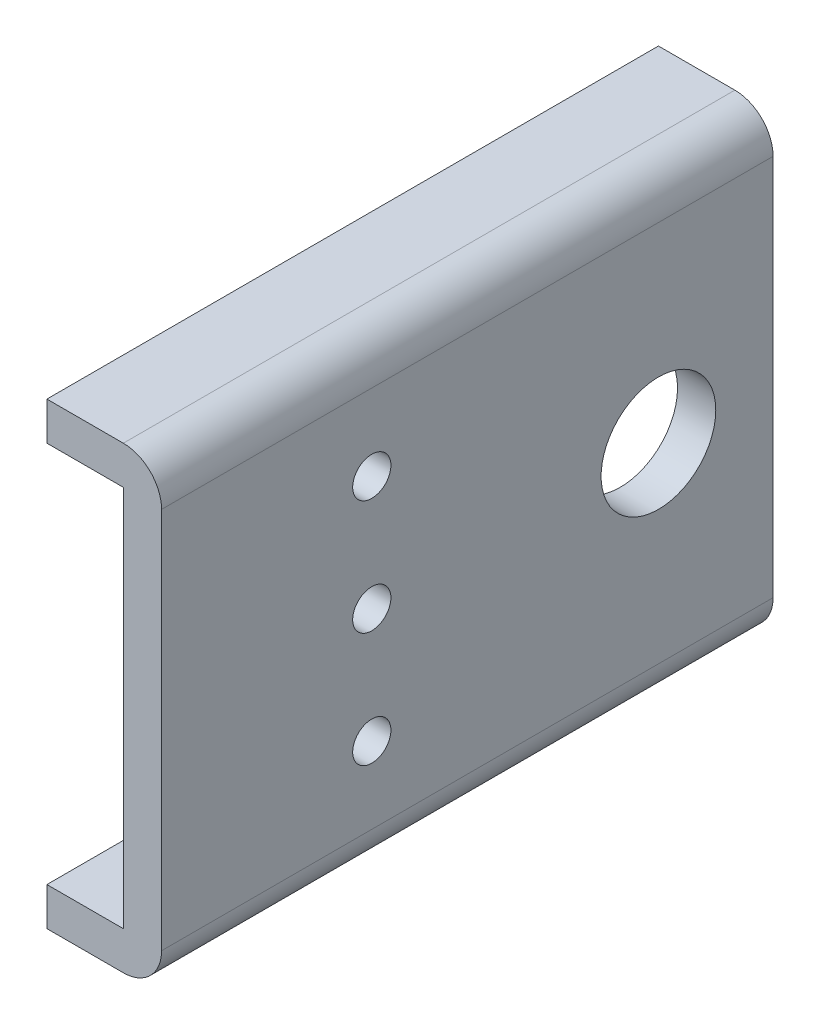
ISO-10303-21;
HEADER;
FILE_DESCRIPTION(('STEP AP214'),'2;1');
FILE_NAME('part.step','',(''),(''),'','','');
FILE_SCHEMA(('AUTOMOTIVE_DESIGN { 1 0 10303 214 1 1 1 1 }'));
ENDSEC;
DATA;
#1=APPLICATION_CONTEXT('core data for automotive mechanical design processes');
#2=APPLICATION_PROTOCOL_DEFINITION('international standard','automotive_design',2000,#1);
#3=PRODUCT_CONTEXT('',#1,'mechanical');
#4=PRODUCT('Part','Part','',(#3));
#5=PRODUCT_RELATED_PRODUCT_CATEGORY('part','',(#4));
#6=PRODUCT_DEFINITION_FORMATION('','',#4);
#7=PRODUCT_DEFINITION_CONTEXT('part definition',#1,'design');
#8=PRODUCT_DEFINITION('design','',#6,#7);
#9=PRODUCT_DEFINITION_SHAPE('','',#8);
#10=(LENGTH_UNIT() NAMED_UNIT(*) SI_UNIT(.MILLI.,.METRE.));
#11=(NAMED_UNIT(*) PLANE_ANGLE_UNIT() SI_UNIT($,.RADIAN.));
#12=(NAMED_UNIT(*) SI_UNIT($,.STERADIAN.) SOLID_ANGLE_UNIT());
#13=UNCERTAINTY_MEASURE_WITH_UNIT(LENGTH_MEASURE(1.E-05),#10,'distance_accuracy_value','');
#14=(GEOMETRIC_REPRESENTATION_CONTEXT(3) GLOBAL_UNCERTAINTY_ASSIGNED_CONTEXT((#13)) GLOBAL_UNIT_ASSIGNED_CONTEXT((#10,
#11,#12)) REPRESENTATION_CONTEXT('',''));
#15=CARTESIAN_POINT('',(0.,0.,0.));
#16=DIRECTION('',(0.,0.,1.));
#17=DIRECTION('',(1.,0.,0.));
#18=AXIS2_PLACEMENT_3D('',#15,#16,#17);
#19=CARTESIAN_POINT('',(0.,-19.05,0.));
#20=DIRECTION('',(0.,1.,0.));
#21=DIRECTION('',(-1.,0.,0.));
#22=AXIS2_PLACEMENT_3D('',#19,#20,#21);
#23=PLANE('',#22);
#24=DIRECTION('',(0.,0.,1.));
#25=VECTOR('',#24,1.);
#26=CARTESIAN_POINT('',(-9.525,-19.05,0.));
#27=LINE('',#26,#25);
#28=CARTESIAN_POINT('',(-9.525,-19.05,50.8));
#29=VERTEX_POINT('',#28);
#30=CARTESIAN_POINT('',(-9.52500000000001,-19.05,0.));
#31=VERTEX_POINT('',#30);
#32=EDGE_CURVE('E103',#29,#31,#27,.F.);
#33=ORIENTED_EDGE('',*,*,#32,.T.);
#34=DIRECTION('',(1.,0.,0.));
#35=VECTOR('',#34,1.);
#36=CARTESIAN_POINT('',(-3.17499999999999,-19.05,0.));
#37=LINE('',#36,#35);
#38=CARTESIAN_POINT('',(-3.17499999999999,-19.05,0.));
#39=VERTEX_POINT('',#38);
#40=EDGE_CURVE('E101',#31,#39,#37,.T.);
#41=ORIENTED_EDGE('',*,*,#40,.T.);
#42=DIRECTION('',(0.,0.,-1.));
#43=VECTOR('',#42,1.);
#44=CARTESIAN_POINT('',(-3.17499999999999,-19.05,0.));
#45=LINE('',#44,#43);
#46=CARTESIAN_POINT('',(-3.17499999999999,-19.05,50.8));
#47=VERTEX_POINT('',#46);
#48=EDGE_CURVE('E90',#47,#39,#45,.T.);
#49=ORIENTED_EDGE('',*,*,#48,.F.);
#50=DIRECTION('',(-1.,0.,0.));
#51=VECTOR('',#50,1.);
#52=CARTESIAN_POINT('',(-9.525,-19.05,50.8));
#53=LINE('',#52,#51);
#54=EDGE_CURVE('E97',#47,#29,#53,.T.);
#55=ORIENTED_EDGE('',*,*,#54,.T.);
#56=EDGE_LOOP('',(#33,#41,#49,#55));
#57=FACE_BOUND('',#56,.T.);
#58=ADVANCED_FACE('F17',(#57),#23,.F.);
#59=CARTESIAN_POINT('',(0.,19.05,0.));
#60=DIRECTION('',(0.,-1.,0.));
#61=DIRECTION('',(1.,0.,0.));
#62=AXIS2_PLACEMENT_3D('',#59,#60,#61);
#63=PLANE('',#62);
#64=DIRECTION('',(0.,0.,1.));
#65=VECTOR('',#64,1.);
#66=CARTESIAN_POINT('',(-9.525,19.05,50.8));
#67=LINE('',#66,#65);
#68=CARTESIAN_POINT('',(-9.525,19.05,0.));
#69=VERTEX_POINT('',#68);
#70=CARTESIAN_POINT('',(-9.52500000000001,19.05,50.8));
#71=VERTEX_POINT('',#70);
#72=EDGE_CURVE('E146',#69,#71,#67,.T.);
#73=ORIENTED_EDGE('',*,*,#72,.T.);
#74=DIRECTION('',(1.,0.,0.));
#75=VECTOR('',#74,1.);
#76=CARTESIAN_POINT('',(-3.17499999999999,19.05,50.8));
#77=LINE('',#76,#75);
#78=CARTESIAN_POINT('',(-3.17499999999999,19.05,50.8));
#79=VERTEX_POINT('',#78);
#80=EDGE_CURVE('E140',#71,#79,#77,.T.);
#81=ORIENTED_EDGE('',*,*,#80,.T.);
#82=DIRECTION('',(0.,0.,1.));
#83=VECTOR('',#82,1.);
#84=CARTESIAN_POINT('',(-3.17499999999999,19.05,50.8));
#85=LINE('',#84,#83);
#86=CARTESIAN_POINT('',(-3.17499999999999,19.05,0.));
#87=VERTEX_POINT('',#86);
#88=EDGE_CURVE('E98',#87,#79,#85,.T.);
#89=ORIENTED_EDGE('',*,*,#88,.F.);
#90=DIRECTION('',(1.,0.,0.));
#91=VECTOR('',#90,1.);
#92=CARTESIAN_POINT('',(-9.525,19.05,0.));
#93=LINE('',#92,#91);
#94=EDGE_CURVE('E116',#87,#69,#93,.F.);
#95=ORIENTED_EDGE('',*,*,#94,.T.);
#96=EDGE_LOOP('',(#73,#81,#89,#95));
#97=FACE_BOUND('',#96,.T.);
#98=ADVANCED_FACE('F256',(#97),#63,.F.);
#99=CARTESIAN_POINT('',(-3.175,15.875,50.8));
#100=DIRECTION('',(0.,0.,1.));
#101=DIRECTION('',(0.,-1.,0.));
#102=AXIS2_PLACEMENT_3D('',#99,#100,#101);
#103=CYLINDRICAL_SURFACE('',#102,3.175);
#104=CARTESIAN_POINT('',(-3.175,15.875,0.));
#105=DIRECTION('',(0.,0.,1.));
#106=DIRECTION('',(0.,-1.,0.));
#107=AXIS2_PLACEMENT_3D('',#104,#105,#106);
#108=CIRCLE('',#107,3.175);
#109=CARTESIAN_POINT('',(0.,15.875,0.));
#110=VERTEX_POINT('',#109);
#111=EDGE_CURVE('E114',#87,#110,#108,.F.);
#112=ORIENTED_EDGE('',*,*,#111,.F.);
#113=ORIENTED_EDGE('',*,*,#88,.T.);
#114=CARTESIAN_POINT('',(-3.175,15.875,50.8));
#115=DIRECTION('',(0.,0.,1.));
#116=DIRECTION('',(0.,-1.,0.));
#117=AXIS2_PLACEMENT_3D('',#114,#115,#116);
#118=CIRCLE('',#117,3.175);
#119=CARTESIAN_POINT('',(0.,15.875,50.8));
#120=VERTEX_POINT('',#119);
#121=EDGE_CURVE('E191',#79,#120,#118,.F.);
#122=ORIENTED_EDGE('',*,*,#121,.T.);
#123=DIRECTION('',(0.,0.,-1.));
#124=VECTOR('',#123,1.);
#125=CARTESIAN_POINT('',(0.,15.875,0.));
#126=LINE('',#125,#124);
#127=EDGE_CURVE('E193',#110,#120,#126,.F.);
#128=ORIENTED_EDGE('',*,*,#127,.F.);
#129=EDGE_LOOP('',(#112,#113,#122,#128));
#130=FACE_BOUND('',#129,.T.);
#131=ADVANCED_FACE('F258',(#130),#103,.T.);
#132=CARTESIAN_POINT('',(-3.175,-15.875,0.));
#133=DIRECTION('',(0.,0.,-1.));
#134=DIRECTION('',(-1.,0.,0.));
#135=AXIS2_PLACEMENT_3D('',#132,#133,#134);
#136=CYLINDRICAL_SURFACE('',#135,3.175);
#137=CARTESIAN_POINT('',(-3.175,-15.875,50.8));
#138=DIRECTION('',(0.,0.,-1.));
#139=DIRECTION('',(-1.,0.,0.));
#140=AXIS2_PLACEMENT_3D('',#137,#138,#139);
#141=CIRCLE('',#140,3.175);
#142=CARTESIAN_POINT('',(0.,-15.875,50.8));
#143=VERTEX_POINT('',#142);
#144=EDGE_CURVE('E95',#47,#143,#141,.F.);
#145=ORIENTED_EDGE('',*,*,#144,.F.);
#146=ORIENTED_EDGE('',*,*,#48,.T.);
#147=CARTESIAN_POINT('',(-3.175,-15.875,0.));
#148=DIRECTION('',(0.,0.,-1.));
#149=DIRECTION('',(-1.,0.,0.));
#150=AXIS2_PLACEMENT_3D('',#147,#148,#149);
#151=CIRCLE('',#150,3.175);
#152=CARTESIAN_POINT('',(0.,-15.875,0.));
#153=VERTEX_POINT('',#152);
#154=EDGE_CURVE('E20',#39,#153,#151,.F.);
#155=ORIENTED_EDGE('',*,*,#154,.T.);
#156=DIRECTION('',(0.,0.,-1.));
#157=VECTOR('',#156,1.);
#158=CARTESIAN_POINT('',(0.,-15.875,0.));
#159=LINE('',#158,#157);
#160=EDGE_CURVE('E197',#143,#153,#159,.T.);
#161=ORIENTED_EDGE('',*,*,#160,.F.);
#162=EDGE_LOOP('',(#145,#146,#155,#161));
#163=FACE_BOUND('',#162,.T.);
#164=ADVANCED_FACE('F92',(#163),#136,.T.);
#165=CARTESIAN_POINT('',(-9.525,-19.05,0.));
#166=DIRECTION('',(1.,0.,0.));
#167=DIRECTION('',(0.,1.,0.));
#168=AXIS2_PLACEMENT_3D('',#165,#166,#167);
#169=PLANE('',#168);
#170=DIRECTION('',(0.,1.,0.));
#171=VECTOR('',#170,1.);
#172=CARTESIAN_POINT('',(-9.525,-19.05,0.));
#173=LINE('',#172,#171);
#174=CARTESIAN_POINT('',(-9.52500000000001,-15.875,0.));
#175=VERTEX_POINT('',#174);
#176=EDGE_CURVE('E115',#31,#175,#173,.T.);
#177=ORIENTED_EDGE('',*,*,#176,.F.);
#178=ORIENTED_EDGE('',*,*,#32,.F.);
#179=DIRECTION('',(0.,1.,0.));
#180=VECTOR('',#179,1.);
#181=CARTESIAN_POINT('',(-9.525,-19.05,50.8));
#182=LINE('',#181,#180);
#183=CARTESIAN_POINT('',(-9.52500000000001,-15.875,50.8));
#184=VERTEX_POINT('',#183);
#185=EDGE_CURVE('E107',#184,#29,#182,.F.);
#186=ORIENTED_EDGE('',*,*,#185,.F.);
#187=DIRECTION('',(0.,0.,1.));
#188=VECTOR('',#187,1.);
#189=CARTESIAN_POINT('',(-9.52500000000001,-15.875,0.));
#190=LINE('',#189,#188);
#191=EDGE_CURVE('E126',#175,#184,#190,.T.);
#192=ORIENTED_EDGE('',*,*,#191,.F.);
#193=EDGE_LOOP('',(#177,#178,#186,#192));
#194=FACE_BOUND('',#193,.T.);
#195=ADVANCED_FACE('F265',(#194),#169,.F.);
#196=CARTESIAN_POINT('',(-9.525,19.05,50.8));
#197=DIRECTION('',(1.,0.,0.));
#198=DIRECTION('',(0.,1.,0.));
#199=AXIS2_PLACEMENT_3D('',#196,#197,#198);
#200=PLANE('',#199);
#201=DIRECTION('',(0.,1.,0.));
#202=VECTOR('',#201,1.);
#203=CARTESIAN_POINT('',(-9.525,19.05,50.8));
#204=LINE('',#203,#202);
#205=CARTESIAN_POINT('',(-9.52500000000001,15.875,50.8));
#206=VERTEX_POINT('',#205);
#207=EDGE_CURVE('E149',#71,#206,#204,.F.);
#208=ORIENTED_EDGE('',*,*,#207,.F.);
#209=ORIENTED_EDGE('',*,*,#72,.F.);
#210=DIRECTION('',(0.,1.,0.));
#211=VECTOR('',#210,1.);
#212=CARTESIAN_POINT('',(-9.525,19.05,0.));
#213=LINE('',#212,#211);
#214=CARTESIAN_POINT('',(-9.52500000000001,15.875,0.));
#215=VERTEX_POINT('',#214);
#216=EDGE_CURVE('E143',#215,#69,#213,.T.);
#217=ORIENTED_EDGE('',*,*,#216,.F.);
#218=DIRECTION('',(0.,0.,1.));
#219=VECTOR('',#218,1.);
#220=CARTESIAN_POINT('',(-9.52500000000001,15.875,0.));
#221=LINE('',#220,#219);
#222=EDGE_CURVE('E209',#206,#215,#221,.F.);
#223=ORIENTED_EDGE('',*,*,#222,.F.);
#224=EDGE_LOOP('',(#208,#209,#217,#223));
#225=FACE_BOUND('',#224,.T.);
#226=ADVANCED_FACE('F254',(#225),#200,.F.);
#227=CARTESIAN_POINT('',(0.,0.,0.));
#228=DIRECTION('',(1.,0.,0.));
#229=DIRECTION('',(0.,0.,-1.));
#230=AXIS2_PLACEMENT_3D('',#227,#228,#229);
#231=PLANE('',#230);
#232=DIRECTION('',(0.,1.,0.));
#233=VECTOR('',#232,1.);
#234=CARTESIAN_POINT('',(0.,15.875,0.));
#235=LINE('',#234,#233);
#236=EDGE_CURVE('E113',#110,#153,#235,.F.);
#237=ORIENTED_EDGE('',*,*,#236,.F.);
#238=ORIENTED_EDGE('',*,*,#127,.T.);
#239=DIRECTION('',(0.,1.,0.));
#240=VECTOR('',#239,1.);
#241=CARTESIAN_POINT('',(0.,15.875,50.8));
#242=LINE('',#241,#240);
#243=EDGE_CURVE('E176',#143,#120,#242,.T.);
#244=ORIENTED_EDGE('',*,*,#243,.F.);
#245=ORIENTED_EDGE('',*,*,#160,.T.);
#246=EDGE_LOOP('',(#237,#238,#244,#245));
#247=FACE_BOUND('',#246,.T.);
#248=CARTESIAN_POINT('',(0.,9.525,33.3375));
#249=DIRECTION('',(1.,0.,0.));
#250=DIRECTION('',(0.,0.,-1.));
#251=AXIS2_PLACEMENT_3D('',#248,#249,#250);
#252=CIRCLE('',#251,1.5875);
#253=CARTESIAN_POINT('',(0.,9.525,31.75));
#254=VERTEX_POINT('',#253);
#255=EDGE_CURVE('E177',#254,#254,#252,.F.);
#256=ORIENTED_EDGE('',*,*,#255,.T.);
#257=EDGE_LOOP('',(#256));
#258=FACE_BOUND('',#257,.T.);
#259=CARTESIAN_POINT('',(0.,-9.525,33.3375));
#260=DIRECTION('',(1.,0.,0.));
#261=DIRECTION('',(0.,0.,-1.));
#262=AXIS2_PLACEMENT_3D('',#259,#260,#261);
#263=CIRCLE('',#262,1.5875);
#264=CARTESIAN_POINT('',(0.,-9.525,31.75));
#265=VERTEX_POINT('',#264);
#266=EDGE_CURVE('E181',#265,#265,#263,.F.);
#267=ORIENTED_EDGE('',*,*,#266,.T.);
#268=EDGE_LOOP('',(#267));
#269=FACE_BOUND('',#268,.T.);
#270=CARTESIAN_POINT('',(0.,0.,9.525));
#271=DIRECTION('',(1.,0.,0.));
#272=DIRECTION('',(0.,0.,-1.));
#273=AXIS2_PLACEMENT_3D('',#270,#271,#272);
#274=CIRCLE('',#273,4.7625);
#275=CARTESIAN_POINT('',(0.,0.,4.7625));
#276=VERTEX_POINT('',#275);
#277=EDGE_CURVE('E184',#276,#276,#274,.F.);
#278=ORIENTED_EDGE('',*,*,#277,.T.);
#279=EDGE_LOOP('',(#278));
#280=FACE_BOUND('',#279,.T.);
#281=CARTESIAN_POINT('',(0.,0.,33.3375));
#282=DIRECTION('',(1.,0.,0.));
#283=DIRECTION('',(0.,0.,-1.));
#284=AXIS2_PLACEMENT_3D('',#281,#282,#283);
#285=CIRCLE('',#284,1.5875);
#286=CARTESIAN_POINT('',(0.,0.,31.75));
#287=VERTEX_POINT('',#286);
#288=EDGE_CURVE('E187',#287,#287,#285,.F.);
#289=ORIENTED_EDGE('',*,*,#288,.T.);
#290=EDGE_LOOP('',(#289));
#291=FACE_BOUND('',#290,.T.);
#292=ADVANCED_FACE('F259',(#247,#258,#269,#280,#291),#231,.T.);
#293=CARTESIAN_POINT('',(-9.52500000000001,0.,33.3375));
#294=DIRECTION('',(1.,0.,0.));
#295=DIRECTION('',(0.,0.,-1.));
#296=AXIS2_PLACEMENT_3D('',#293,#294,#295);
#297=CYLINDRICAL_SURFACE('',#296,1.5875);
#298=CARTESIAN_POINT('',(-3.175,0.,33.3375));
#299=DIRECTION('',(1.,0.,0.));
#300=DIRECTION('',(0.,0.,-1.));
#301=AXIS2_PLACEMENT_3D('',#298,#299,#300);
#302=CIRCLE('',#301,1.5875);
#303=CARTESIAN_POINT('',(-3.175,0.,31.75));
#304=VERTEX_POINT('',#303);
#305=EDGE_CURVE('E173',#304,#304,#302,.F.);
#306=ORIENTED_EDGE('',*,*,#305,.T.);
#307=EDGE_LOOP('',(#306));
#308=FACE_BOUND('',#307,.T.);
#309=ORIENTED_EDGE('',*,*,#288,.F.);
#310=EDGE_LOOP('',(#309));
#311=FACE_BOUND('',#310,.T.);
#312=ADVANCED_FACE('F299',(#308,#311),#297,.F.);
#313=CARTESIAN_POINT('',(-9.52500000000001,0.,9.525));
#314=DIRECTION('',(1.,0.,0.));
#315=DIRECTION('',(0.,0.,-1.));
#316=AXIS2_PLACEMENT_3D('',#313,#314,#315);
#317=CYLINDRICAL_SURFACE('',#316,4.7625);
#318=CARTESIAN_POINT('',(-3.175,0.,9.525));
#319=DIRECTION('',(1.,0.,0.));
#320=DIRECTION('',(0.,0.,-1.));
#321=AXIS2_PLACEMENT_3D('',#318,#319,#320);
#322=CIRCLE('',#321,4.7625);
#323=CARTESIAN_POINT('',(-3.175,0.,4.7625));
#324=VERTEX_POINT('',#323);
#325=EDGE_CURVE('E170',#324,#324,#322,.F.);
#326=ORIENTED_EDGE('',*,*,#325,.T.);
#327=EDGE_LOOP('',(#326));
#328=FACE_BOUND('',#327,.T.);
#329=ORIENTED_EDGE('',*,*,#277,.F.);
#330=EDGE_LOOP('',(#329));
#331=FACE_BOUND('',#330,.T.);
#332=ADVANCED_FACE('F295',(#328,#331),#317,.F.);
#333=CARTESIAN_POINT('',(-9.52500000000001,-9.525,33.3375));
#334=DIRECTION('',(1.,0.,0.));
#335=DIRECTION('',(0.,0.,-1.));
#336=AXIS2_PLACEMENT_3D('',#333,#334,#335);
#337=CYLINDRICAL_SURFACE('',#336,1.5875);
#338=CARTESIAN_POINT('',(-3.175,-9.525,33.3375));
#339=DIRECTION('',(1.,0.,0.));
#340=DIRECTION('',(0.,0.,-1.));
#341=AXIS2_PLACEMENT_3D('',#338,#339,#340);
#342=CIRCLE('',#341,1.5875);
#343=CARTESIAN_POINT('',(-3.175,-9.525,31.75));
#344=VERTEX_POINT('',#343);
#345=EDGE_CURVE('E167',#344,#344,#342,.F.);
#346=ORIENTED_EDGE('',*,*,#345,.T.);
#347=EDGE_LOOP('',(#346));
#348=FACE_BOUND('',#347,.T.);
#349=ORIENTED_EDGE('',*,*,#266,.F.);
#350=EDGE_LOOP('',(#349));
#351=FACE_BOUND('',#350,.T.);
#352=ADVANCED_FACE('F291',(#348,#351),#337,.F.);
#353=CARTESIAN_POINT('',(-9.52500000000001,9.525,33.3375));
#354=DIRECTION('',(1.,0.,0.));
#355=DIRECTION('',(0.,0.,-1.));
#356=AXIS2_PLACEMENT_3D('',#353,#354,#355);
#357=CYLINDRICAL_SURFACE('',#356,1.5875);
#358=CARTESIAN_POINT('',(-3.175,9.525,33.3375));
#359=DIRECTION('',(1.,0.,0.));
#360=DIRECTION('',(0.,0.,-1.));
#361=AXIS2_PLACEMENT_3D('',#358,#359,#360);
#362=CIRCLE('',#361,1.5875);
#363=CARTESIAN_POINT('',(-3.175,9.525,31.75));
#364=VERTEX_POINT('',#363);
#365=EDGE_CURVE('E163',#364,#364,#362,.F.);
#366=ORIENTED_EDGE('',*,*,#365,.T.);
#367=EDGE_LOOP('',(#366));
#368=FACE_BOUND('',#367,.T.);
#369=ORIENTED_EDGE('',*,*,#255,.F.);
#370=EDGE_LOOP('',(#369));
#371=FACE_BOUND('',#370,.T.);
#372=ADVANCED_FACE('F288',(#368,#371),#357,.F.);
#373=CARTESIAN_POINT('',(0.,-15.875,0.));
#374=DIRECTION('',(0.,1.,0.));
#375=DIRECTION('',(-1.,0.,0.));
#376=AXIS2_PLACEMENT_3D('',#373,#374,#375);
#377=PLANE('',#376);
#378=DIRECTION('',(-1.,0.,0.));
#379=VECTOR('',#378,1.);
#380=CARTESIAN_POINT('',(0.,-15.875,0.));
#381=LINE('',#380,#379);
#382=CARTESIAN_POINT('',(-3.175,-15.875,0.));
#383=VERTEX_POINT('',#382);
#384=EDGE_CURVE('E129',#383,#175,#381,.T.);
#385=ORIENTED_EDGE('',*,*,#384,.T.);
#386=ORIENTED_EDGE('',*,*,#191,.T.);
#387=DIRECTION('',(-1.,0.,0.));
#388=VECTOR('',#387,1.);
#389=CARTESIAN_POINT('',(0.,-15.875,50.8));
#390=LINE('',#389,#388);
#391=CARTESIAN_POINT('',(-3.175,-15.875,50.8));
#392=VERTEX_POINT('',#391);
#393=EDGE_CURVE('E180',#184,#392,#390,.F.);
#394=ORIENTED_EDGE('',*,*,#393,.T.);
#395=DIRECTION('',(0.,0.,-1.));
#396=VECTOR('',#395,1.);
#397=CARTESIAN_POINT('',(-3.175,-15.875,0.));
#398=LINE('',#397,#396);
#399=EDGE_CURVE('E166',#392,#383,#398,.T.);
#400=ORIENTED_EDGE('',*,*,#399,.T.);
#401=EDGE_LOOP('',(#385,#386,#394,#400));
#402=FACE_BOUND('',#401,.T.);
#403=ADVANCED_FACE('F262',(#402),#377,.T.);
#404=CARTESIAN_POINT('',(-3.175,15.875,0.));
#405=DIRECTION('',(0.,0.,-1.));
#406=DIRECTION('',(-1.,0.,0.));
#407=AXIS2_PLACEMENT_3D('',#404,#405,#406);
#408=PLANE('',#407);
#409=DIRECTION('',(0.,1.,0.));
#410=VECTOR('',#409,1.);
#411=CARTESIAN_POINT('',(-3.175,0.,0.));
#412=LINE('',#411,#410);
#413=CARTESIAN_POINT('',(-3.175,15.875,0.));
#414=VERTEX_POINT('',#413);
#415=EDGE_CURVE('E219',#383,#414,#412,.T.);
#416=ORIENTED_EDGE('',*,*,#415,.T.);
#417=DIRECTION('',(1.,0.,0.));
#418=VECTOR('',#417,1.);
#419=CARTESIAN_POINT('',(0.,15.875,0.));
#420=LINE('',#419,#418);
#421=EDGE_CURVE('E215',#215,#414,#420,.T.);
#422=ORIENTED_EDGE('',*,*,#421,.F.);
#423=ORIENTED_EDGE('',*,*,#216,.T.);
#424=ORIENTED_EDGE('',*,*,#94,.F.);
#425=ORIENTED_EDGE('',*,*,#111,.T.);
#426=ORIENTED_EDGE('',*,*,#236,.T.);
#427=ORIENTED_EDGE('',*,*,#154,.F.);
#428=ORIENTED_EDGE('',*,*,#40,.F.);
#429=ORIENTED_EDGE('',*,*,#176,.T.);
#430=ORIENTED_EDGE('',*,*,#384,.F.);
#431=EDGE_LOOP('',(#416,#422,#423,#424,#425,#426,#427,#428,#429,#430));
#432=FACE_BOUND('',#431,.T.);
#433=ADVANCED_FACE('F111',(#432),#408,.T.);
#434=CARTESIAN_POINT('',(0.,15.875,0.));
#435=DIRECTION('',(0.,-1.,0.));
#436=DIRECTION('',(1.,0.,0.));
#437=AXIS2_PLACEMENT_3D('',#434,#435,#436);
#438=PLANE('',#437);
#439=DIRECTION('',(1.,0.,0.));
#440=VECTOR('',#439,1.);
#441=CARTESIAN_POINT('',(0.,15.875,50.8));
#442=LINE('',#441,#440);
#443=CARTESIAN_POINT('',(-3.175,15.875,50.8));
#444=VERTEX_POINT('',#443);
#445=EDGE_CURVE('E34',#444,#206,#442,.F.);
#446=ORIENTED_EDGE('',*,*,#445,.T.);
#447=ORIENTED_EDGE('',*,*,#222,.T.);
#448=ORIENTED_EDGE('',*,*,#421,.T.);
#449=DIRECTION('',(0.,0.,-1.));
#450=VECTOR('',#449,1.);
#451=CARTESIAN_POINT('',(-3.175,15.875,0.));
#452=LINE('',#451,#450);
#453=EDGE_CURVE('E26',#414,#444,#452,.F.);
#454=ORIENTED_EDGE('',*,*,#453,.T.);
#455=EDGE_LOOP('',(#446,#447,#448,#454));
#456=FACE_BOUND('',#455,.T.);
#457=ADVANCED_FACE('F243',(#456),#438,.T.);
#458=CARTESIAN_POINT('',(-3.175,15.875,50.8));
#459=DIRECTION('',(0.,0.,1.));
#460=DIRECTION('',(1.,0.,0.));
#461=AXIS2_PLACEMENT_3D('',#458,#459,#460);
#462=PLANE('',#461);
#463=DIRECTION('',(0.,1.,0.));
#464=VECTOR('',#463,1.);
#465=CARTESIAN_POINT('',(-3.175,0.,50.8));
#466=LINE('',#465,#464);
#467=EDGE_CURVE('E11',#444,#392,#466,.F.);
#468=ORIENTED_EDGE('',*,*,#467,.T.);
#469=ORIENTED_EDGE('',*,*,#393,.F.);
#470=ORIENTED_EDGE('',*,*,#185,.T.);
#471=ORIENTED_EDGE('',*,*,#54,.F.);
#472=ORIENTED_EDGE('',*,*,#144,.T.);
#473=ORIENTED_EDGE('',*,*,#243,.T.);
#474=ORIENTED_EDGE('',*,*,#121,.F.);
#475=ORIENTED_EDGE('',*,*,#80,.F.);
#476=ORIENTED_EDGE('',*,*,#207,.T.);
#477=ORIENTED_EDGE('',*,*,#445,.F.);
#478=EDGE_LOOP('',(#468,#469,#470,#471,#472,#473,#474,#475,#476,#477));
#479=FACE_BOUND('',#478,.T.);
#480=ADVANCED_FACE('F263',(#479),#462,.T.);
#481=CARTESIAN_POINT('',(-3.175,0.,0.));
#482=DIRECTION('',(1.,0.,0.));
#483=DIRECTION('',(0.,0.,-1.));
#484=AXIS2_PLACEMENT_3D('',#481,#482,#483);
#485=PLANE('',#484);
#486=ORIENTED_EDGE('',*,*,#453,.F.);
#487=ORIENTED_EDGE('',*,*,#415,.F.);
#488=ORIENTED_EDGE('',*,*,#399,.F.);
#489=ORIENTED_EDGE('',*,*,#467,.F.);
#490=EDGE_LOOP('',(#486,#487,#488,#489));
#491=FACE_BOUND('',#490,.T.);
#492=ORIENTED_EDGE('',*,*,#365,.F.);
#493=EDGE_LOOP('',(#492));
#494=FACE_BOUND('',#493,.T.);
#495=ORIENTED_EDGE('',*,*,#345,.F.);
#496=EDGE_LOOP('',(#495));
#497=FACE_BOUND('',#496,.T.);
#498=ORIENTED_EDGE('',*,*,#325,.F.);
#499=EDGE_LOOP('',(#498));
#500=FACE_BOUND('',#499,.T.);
#501=ORIENTED_EDGE('',*,*,#305,.F.);
#502=EDGE_LOOP('',(#501));
#503=FACE_BOUND('',#502,.T.);
#504=ADVANCED_FACE('F247',(#491,#494,#497,#500,#503),#485,.F.);
#505=CLOSED_SHELL('',(#58,#98,#131,#164,#195,#226,#292,#312,#332,#352,#372,#403,#433,#457,#480,#504));
#506=MANIFOLD_SOLID_BREP('B1',#505);
#507=ADVANCED_BREP_SHAPE_REPRESENTATION('',(#18,#506),#14);
#508=SHAPE_DEFINITION_REPRESENTATION(#9,#507);
ENDSEC;
END-ISO-10303-21;
